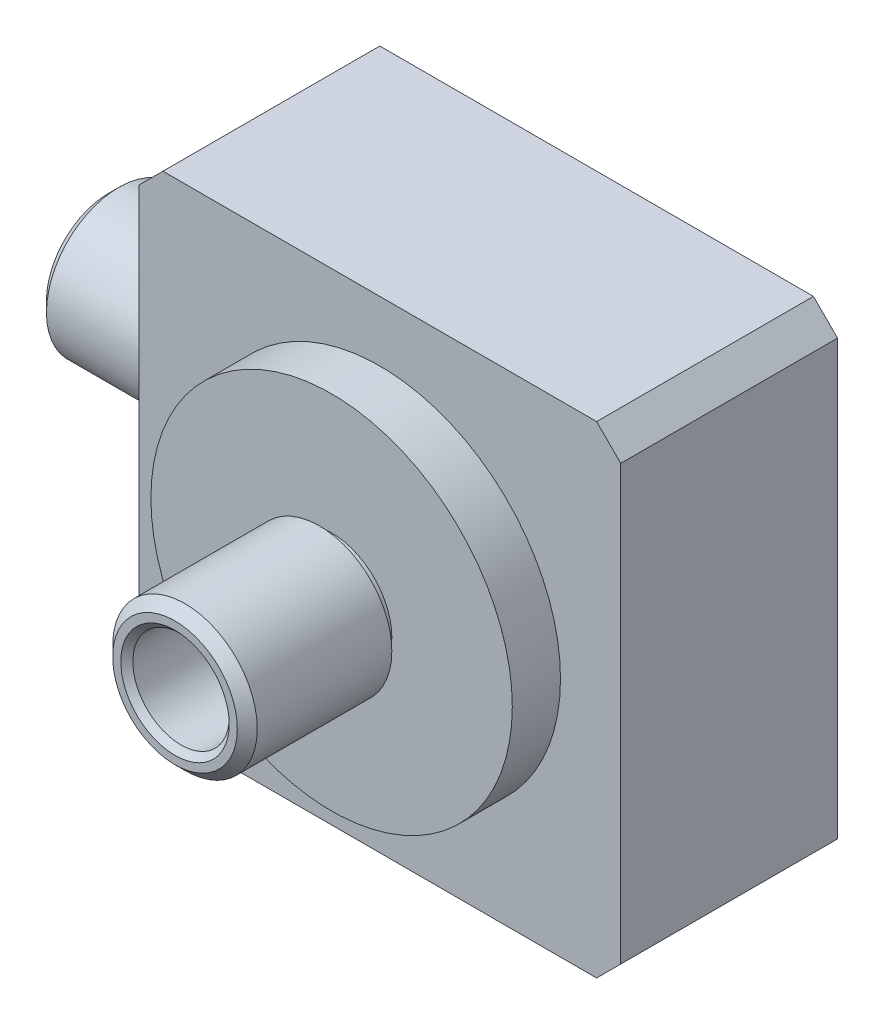
ISO-10303-21;
HEADER;
FILE_DESCRIPTION(('STEP AP214'),'2;1');
FILE_NAME('part.step','',(''),(''),'','','');
FILE_SCHEMA(('AUTOMOTIVE_DESIGN { 1 0 10303 214 1 1 1 1 }'));
ENDSEC;
DATA;
#1=APPLICATION_CONTEXT('core data for automotive mechanical design processes');
#2=APPLICATION_PROTOCOL_DEFINITION('international standard','automotive_design',2000,#1);
#3=PRODUCT_CONTEXT('',#1,'mechanical');
#4=PRODUCT('Part','Part','',(#3));
#5=PRODUCT_RELATED_PRODUCT_CATEGORY('part','',(#4));
#6=PRODUCT_DEFINITION_FORMATION('','',#4);
#7=PRODUCT_DEFINITION_CONTEXT('part definition',#1,'design');
#8=PRODUCT_DEFINITION('design','',#6,#7);
#9=PRODUCT_DEFINITION_SHAPE('','',#8);
#10=(LENGTH_UNIT() NAMED_UNIT(*) SI_UNIT(.MILLI.,.METRE.));
#11=(NAMED_UNIT(*) PLANE_ANGLE_UNIT() SI_UNIT($,.RADIAN.));
#12=(NAMED_UNIT(*) SI_UNIT($,.STERADIAN.) SOLID_ANGLE_UNIT());
#13=UNCERTAINTY_MEASURE_WITH_UNIT(LENGTH_MEASURE(1.E-05),#10,'distance_accuracy_value','');
#14=(GEOMETRIC_REPRESENTATION_CONTEXT(3) GLOBAL_UNCERTAINTY_ASSIGNED_CONTEXT((#13)) GLOBAL_UNIT_ASSIGNED_CONTEXT((#10,
#11,#12)) REPRESENTATION_CONTEXT('',''));
#15=CARTESIAN_POINT('',(0.,0.,0.));
#16=DIRECTION('',(0.,0.,1.));
#17=DIRECTION('',(1.,0.,0.));
#18=AXIS2_PLACEMENT_3D('',#15,#16,#17);
#19=CARTESIAN_POINT('',(0.,0.,0.));
#20=DIRECTION('',(0.,0.,-1.));
#21=DIRECTION('',(-1.,0.,0.));
#22=AXIS2_PLACEMENT_3D('',#19,#20,#21);
#23=PLANE('',#22);
#24=DIRECTION('',(0.,-1.,0.));
#25=VECTOR('',#24,1.);
#26=CARTESIAN_POINT('',(-20.,-20.,0.));
#27=LINE('',#26,#25);
#28=CARTESIAN_POINT('',(-20.,18.,0.));
#29=VERTEX_POINT('',#28);
#30=CARTESIAN_POINT('',(-20.,-18.,0.));
#31=VERTEX_POINT('',#30);
#32=EDGE_CURVE('E119',#29,#31,#27,.T.);
#33=ORIENTED_EDGE('',*,*,#32,.F.);
#34=DIRECTION('',(-0.70710678118655,-0.707106781186545,0.));
#35=VECTOR('',#34,1.);
#36=CARTESIAN_POINT('',(-18.9999999999999,19.0000000000001,0.));
#37=LINE('',#36,#35);
#38=CARTESIAN_POINT('',(-18.,20.,0.));
#39=VERTEX_POINT('',#38);
#40=EDGE_CURVE('E101',#29,#39,#37,.F.);
#41=ORIENTED_EDGE('',*,*,#40,.T.);
#42=DIRECTION('',(-1.,0.,0.));
#43=VECTOR('',#42,1.);
#44=CARTESIAN_POINT('',(-20.,20.,0.));
#45=LINE('',#44,#43);
#46=CARTESIAN_POINT('',(18.,20.,0.));
#47=VERTEX_POINT('',#46);
#48=EDGE_CURVE('E128',#47,#39,#45,.T.);
#49=ORIENTED_EDGE('',*,*,#48,.F.);
#50=DIRECTION('',(-0.707106781186546,0.707106781186549,0.));
#51=VECTOR('',#50,1.);
#52=CARTESIAN_POINT('',(19.,19.,0.));
#53=LINE('',#52,#51);
#54=CARTESIAN_POINT('',(20.,18.,0.));
#55=VERTEX_POINT('',#54);
#56=EDGE_CURVE('E112',#47,#55,#53,.F.);
#57=ORIENTED_EDGE('',*,*,#56,.T.);
#58=DIRECTION('',(0.,1.,0.));
#59=VECTOR('',#58,1.);
#60=CARTESIAN_POINT('',(20.,-20.,0.));
#61=LINE('',#60,#59);
#62=CARTESIAN_POINT('',(20.,-18.,0.));
#63=VERTEX_POINT('',#62);
#64=EDGE_CURVE('E132',#63,#55,#61,.T.);
#65=ORIENTED_EDGE('',*,*,#64,.F.);
#66=DIRECTION('',(0.707106781186549,0.707106781186546,0.));
#67=VECTOR('',#66,1.);
#68=CARTESIAN_POINT('',(19.,-19.,0.));
#69=LINE('',#68,#67);
#70=CARTESIAN_POINT('',(18.,-20.,0.));
#71=VERTEX_POINT('',#70);
#72=EDGE_CURVE('E182',#63,#71,#69,.F.);
#73=ORIENTED_EDGE('',*,*,#72,.T.);
#74=DIRECTION('',(1.,0.,0.));
#75=VECTOR('',#74,1.);
#76=CARTESIAN_POINT('',(-20.,-20.,0.));
#77=LINE('',#76,#75);
#78=CARTESIAN_POINT('',(-18.,-20.,0.));
#79=VERTEX_POINT('',#78);
#80=EDGE_CURVE('E127',#79,#71,#77,.T.);
#81=ORIENTED_EDGE('',*,*,#80,.F.);
#82=DIRECTION('',(0.707106781186545,-0.70710678118655,0.));
#83=VECTOR('',#82,1.);
#84=CARTESIAN_POINT('',(-19.0000000000001,-18.9999999999999,0.));
#85=LINE('',#84,#83);
#86=EDGE_CURVE('E122',#79,#31,#85,.F.);
#87=ORIENTED_EDGE('',*,*,#86,.T.);
#88=EDGE_LOOP('',(#33,#41,#49,#57,#65,#73,#81,#87));
#89=FACE_BOUND('',#88,.T.);
#90=CARTESIAN_POINT('',(0.,0.,0.));
#91=DIRECTION('',(0.,0.,-1.));
#92=DIRECTION('',(-1.,0.,0.));
#93=AXIS2_PLACEMENT_3D('',#90,#91,#92);
#94=CIRCLE('',#93,17.5);
#95=CARTESIAN_POINT('',(-17.5,0.,0.));
#96=VERTEX_POINT('',#95);
#97=EDGE_CURVE('E405',#96,#96,#94,.T.);
#98=ORIENTED_EDGE('',*,*,#97,.F.);
#99=EDGE_LOOP('',(#98));
#100=FACE_BOUND('',#99,.T.);
#101=ADVANCED_FACE('F36',(#89,#100),#23,.T.);
#102=CARTESIAN_POINT('',(0.,0.,0.));
#103=DIRECTION('',(0.,0.,-1.));
#104=DIRECTION('',(-1.,0.,0.));
#105=AXIS2_PLACEMENT_3D('',#102,#103,#104);
#106=CIRCLE('',#105,11.);
#107=CARTESIAN_POINT('',(-11.,0.,0.));
#108=VERTEX_POINT('',#107);
#109=EDGE_CURVE('E147',#108,#108,#106,.T.);
#110=ORIENTED_EDGE('',*,*,#109,.F.);
#111=EDGE_LOOP('',(#110));
#112=FACE_BOUND('',#111,.T.);
#113=CARTESIAN_POINT('',(0.,0.,0.));
#114=DIRECTION('',(0.,0.,-1.));
#115=DIRECTION('',(-1.,0.,0.));
#116=AXIS2_PLACEMENT_3D('',#113,#114,#115);
#117=CIRCLE('',#116,13.5);
#118=CARTESIAN_POINT('',(-13.5,0.,0.));
#119=VERTEX_POINT('',#118);
#120=EDGE_CURVE('E406',#119,#119,#117,.T.);
#121=ORIENTED_EDGE('',*,*,#120,.T.);
#122=EDGE_LOOP('',(#121));
#123=FACE_BOUND('',#122,.T.);
#124=ADVANCED_FACE('F342',(#112,#123),#23,.T.);
#125=CARTESIAN_POINT('',(20.001,0.,6.99999999999999));
#126=DIRECTION('',(-1.,0.,0.));
#127=DIRECTION('',(0.,0.,1.));
#128=AXIS2_PLACEMENT_3D('',#125,#126,#127);
#129=CYLINDRICAL_SURFACE('',#128,2.5);
#130=CARTESIAN_POINT('',(-11.,0.,9.49999999999999));
#131=CARTESIAN_POINT('',(-10.9999974735185,0.138518278596904,9.49999546817358));
#132=CARTESIAN_POINT('',(-10.9973570934613,0.277090172258008,9.48844877242309));
#133=CARTESIAN_POINT('',(-10.987079320306,0.550288594599323,9.4426205239383));
#134=CARTESIAN_POINT('',(-10.9794385496265,0.68491239222073,9.40832360404473));
#135=CARTESIAN_POINT('',(-10.9600095312294,0.946227671984916,9.3181319513681));
#136=CARTESIAN_POINT('',(-10.9482257885674,1.07292759495647,9.26226067201926));
#137=CARTESIAN_POINT('',(-10.921778201627,1.31515227582566,9.13058288661912));
#138=CARTESIAN_POINT('',(-10.9071143860398,1.43067714503182,9.05477657915758));
#139=CARTESIAN_POINT('',(-10.8762265816814,1.64926760444638,8.88399795539332));
#140=CARTESIAN_POINT('',(-10.8599819758326,1.75211293892049,8.78874742652499));
#141=CARTESIAN_POINT('',(-10.827906511833,1.9405138981661,8.58238102586275));
#142=CARTESIAN_POINT('',(-10.8120756930933,2.02606788121784,8.47126364930554));
#143=CARTESIAN_POINT('',(-10.7824158369221,2.17844599401787,8.23466794471631));
#144=CARTESIAN_POINT('',(-10.7686131580577,2.24503254356575,8.10903300369416));
#145=CARTESIAN_POINT('',(-10.7448696147509,2.3560606971787,7.84799049941837));
#146=CARTESIAN_POINT('',(-10.7349282488168,2.40050517717749,7.71258420793837));
#147=CARTESIAN_POINT('',(-10.7202434469831,2.46525349412718,7.43824081288346));
#148=CARTESIAN_POINT('',(-10.715415797339,2.48594892680754,7.29940073687745));
#149=CARTESIAN_POINT('',(-10.7112523406768,2.50382988451487,7.02014177278689));
#150=CARTESIAN_POINT('',(-10.711915802658,2.50101853886552,6.87972309733772));
#151=CARTESIAN_POINT('',(-10.7185835035919,2.47228016958762,6.6042271166513));
#152=CARTESIAN_POINT('',(-10.7244819412976,2.44681104599437,6.46909909380508));
#153=CARTESIAN_POINT('',(-10.7407873672743,2.37420684920502,6.20508551384517));
#154=CARTESIAN_POINT('',(-10.7511946264744,2.32707047404288,6.07620033237281));
#155=CARTESIAN_POINT('',(-10.7754474384537,2.21205734402544,5.82705932818946));
#156=CARTESIAN_POINT('',(-10.7893215597825,2.14400712086008,5.70688648223631));
#157=CARTESIAN_POINT('',(-10.8189276843241,1.98921977920408,5.47949744688893));
#158=CARTESIAN_POINT('',(-10.8346599596346,1.90247992237134,5.37228315973606));
#159=CARTESIAN_POINT('',(-10.8666615287251,1.71036518003516,5.17122143817897));
#160=CARTESIAN_POINT('',(-10.882934773515,1.60460166742827,5.07774557348364));
#161=CARTESIAN_POINT('',(-10.9138502597158,1.37871229840972,4.90979411129289));
#162=CARTESIAN_POINT('',(-10.9284924668293,1.2585861400908,4.83531891330052));
#163=CARTESIAN_POINT('',(-10.9545497424637,1.00690799179916,4.70737961202849));
#164=CARTESIAN_POINT('',(-10.9659568484873,0.875328834348159,4.65396722637767));
#165=CARTESIAN_POINT('',(-10.9841998956698,0.604745122491699,4.57011599413207));
#166=CARTESIAN_POINT('',(-10.9910365557784,0.465741739663722,4.53967353417781));
#167=CARTESIAN_POINT('',(-10.9992650071756,0.187439840192734,4.5031737625273));
#168=CARTESIAN_POINT('',(-11.0007700184113,0.0482110923370391,4.49660930868326));
#169=CARTESIAN_POINT('',(-10.9984842255063,-0.229353886680103,4.50667303985292));
#170=CARTESIAN_POINT('',(-10.9946938107912,-0.367690182720858,4.52329951940597));
#171=CARTESIAN_POINT('',(-10.9823148103741,-0.637841677218458,4.57885316690541));
#172=CARTESIAN_POINT('',(-10.973784087055,-0.769715036814425,4.61751154644373));
#173=CARTESIAN_POINT('',(-10.9528806132367,-1.0251039308776,4.71573102745707));
#174=CARTESIAN_POINT('',(-10.9405075180554,-1.14861871432289,4.77529400425326));
#175=CARTESIAN_POINT('',(-10.9130143275095,-1.38586085256056,4.91466914355533));
#176=CARTESIAN_POINT('',(-10.8978552985532,-1.49941068522719,4.99477562677315));
#177=CARTESIAN_POINT('',(-10.866546095646,-1.71163773579052,5.1725793284402));
#178=CARTESIAN_POINT('',(-10.8503957821912,-1.8103128535797,5.27027902654684));
#179=CARTESIAN_POINT('',(-10.8185287714487,-1.99201706218096,5.48283096513342));
#180=CARTESIAN_POINT('',(-10.8028272119253,-2.07469366594062,5.59798724178681));
#181=CARTESIAN_POINT('',(-10.7740023321604,-2.21953814406552,5.84084639067027));
#182=CARTESIAN_POINT('',(-10.7608788979592,-2.28170692501017,5.96854870795962));
#183=CARTESIAN_POINT('',(-10.7388274870674,-2.38333597241927,6.23218046956891));
#184=CARTESIAN_POINT('',(-10.7298753781702,-2.42292716221704,6.36805732374334));
#185=CARTESIAN_POINT('',(-10.7171411058581,-2.47865258340365,6.64476690669912));
#186=CARTESIAN_POINT('',(-10.7133580391079,-2.49479091341614,6.78559876513639));
#187=CARTESIAN_POINT('',(-10.7114502943222,-2.50296739214164,7.06465861931089));
#188=CARTESIAN_POINT('',(-10.7131941458177,-2.4955654850107,7.20286959933359));
#189=CARTESIAN_POINT('',(-10.7218446846914,-2.45813115403283,7.47601891018825));
#190=CARTESIAN_POINT('',(-10.7287513008948,-2.42809904217009,7.61095728611047));
#191=CARTESIAN_POINT('',(-10.7468826027048,-2.34653692360609,7.87324339736628));
#192=CARTESIAN_POINT('',(-10.758089666867,-2.29509457527995,8.00061969114149));
#193=CARTESIAN_POINT('',(-10.783564723281,-2.1722453660688,8.2450147069006));
#194=CARTESIAN_POINT('',(-10.7978330631966,-2.10083623731223,8.3620322503255));
#195=CARTESIAN_POINT('',(-10.828211072634,-1.93824996891049,8.58513442765527));
#196=CARTESIAN_POINT('',(-10.8443540558786,-1.84667645642834,8.69092572220737));
#197=CARTESIAN_POINT('',(-10.8764454859305,-1.64715628932417,8.88582318508195));
#198=CARTESIAN_POINT('',(-10.8923938866665,-1.53920583540675,8.97492547096596));
#199=CARTESIAN_POINT('',(-10.9225693389041,-1.30814060515056,9.13513806023371));
#200=CARTESIAN_POINT('',(-10.9367686161711,-1.1848316218762,9.20597382333313));
#201=CARTESIAN_POINT('',(-10.9615640551399,-0.927755967711687,9.32579997066295));
#202=CARTESIAN_POINT('',(-10.9721631246672,-0.793997844337693,9.37480799478667));
#203=CARTESIAN_POINT('',(-10.9867559512784,-0.55016307153962,9.44122790617612));
#204=CARTESIAN_POINT('',(-10.9916908558499,-0.441368111138487,9.46322398768929));
#205=CARTESIAN_POINT('',(-10.9983138080738,-0.221726814930915,9.49261147357934));
#206=CARTESIAN_POINT('',(-11.0000020223883,-0.1108805847171,9.50000362761916));
#207=CARTESIAN_POINT('',(-11.,0.,9.49999999999999));
#208=B_SPLINE_CURVE_WITH_KNOTS('',3,(#130,#131,#132,#133,#134,#135,#136,#137,#138,#139,#140,
#141,#142,#143,#144,#145,#146,#147,#148,#149,#150,#151,#152,#153,#154,#155,#156,#157,#158,#159,
#160,#161,#162,#163,#164,#165,#166,#167,#168,#169,#170,#171,#172,#173,#174,#175,#176,#177,#178,
#179,#180,#181,#182,#183,#184,#185,#186,#187,#188,#189,#190,#191,#192,#193,#194,#195,#196,#197,
#198,#199,#200,#201,#202,#203,#204,#205,#206,#207),.UNSPECIFIED.,.T.,.F.,(4,2,2,2,2,2,2,2,2,2,2,
2,2,2,2,2,2,2,2,2,2,2,2,2,2,2,2,2,2,2,2,2,2,2,2,2,2,2,4),(0.,0.415148849633315,
0.830578406996929,1.24555761755318,1.66053269430525,2.08192389396809,2.50335508365802,
2.92985362973414,3.35629676538239,3.77560244898082,4.19485231368757,4.60581714174235,
5.01680666753971,5.4313015743885,5.84585725297978,6.27011531803703,6.69438230269862,
7.11968464096647,7.54492006169895,7.96106941916761,8.37718817463626,8.78833576149035,
9.19952024123082,9.61696129328767,10.0344612272567,10.4603132154039,10.8861463755948,
11.3094844190899,11.732748471094,12.1460204395145,12.5592867105953,12.9708773657615,
13.382514789318,13.8031102578591,14.2238034502007,14.6504927745347,15.0768366452215,
15.4091704772436,15.74148724914),.UNSPECIFIED.);
#209=CARTESIAN_POINT('',(-11.,0.,9.49999999999999));
#210=VERTEX_POINT('',#209);
#211=EDGE_CURVE('E155',#210,#210,#208,.T.);
#212=ORIENTED_EDGE('',*,*,#211,.F.);
#213=EDGE_LOOP('',(#212));
#214=FACE_BOUND('',#213,.T.);
#215=CARTESIAN_POINT('',(-23.5,0.,6.99999999999999));
#216=DIRECTION('',(-1.,0.,0.));
#217=DIRECTION('',(0.,0.,1.));
#218=AXIS2_PLACEMENT_3D('',#215,#216,#217);
#219=CIRCLE('',#218,2.5);
#220=CARTESIAN_POINT('',(-23.5,0.,9.49999999999999));
#221=VERTEX_POINT('',#220);
#222=EDGE_CURVE('E152',#221,#221,#219,.F.);
#223=ORIENTED_EDGE('',*,*,#222,.F.);
#224=EDGE_LOOP('',(#223));
#225=FACE_BOUND('',#224,.T.);
#226=ADVANCED_FACE('F264',(#214,#225),#129,.F.);
#227=CARTESIAN_POINT('',(0.,0.,0.));
#228=DIRECTION('',(0.,0.,1.));
#229=DIRECTION('',(1.,0.,0.));
#230=AXIS2_PLACEMENT_3D('',#227,#228,#229);
#231=CYLINDRICAL_SURFACE('',#230,2.5);
#232=CARTESIAN_POINT('',(0.,0.,8.));
#233=DIRECTION('',(0.,0.,-1.));
#234=DIRECTION('',(-1.,0.,0.));
#235=AXIS2_PLACEMENT_3D('',#232,#233,#234);
#236=CIRCLE('',#235,2.5);
#237=CARTESIAN_POINT('',(-2.5,0.,8.));
#238=VERTEX_POINT('',#237);
#239=EDGE_CURVE('E144',#238,#238,#236,.T.);
#240=ORIENTED_EDGE('',*,*,#239,.T.);
#241=EDGE_LOOP('',(#240));
#242=FACE_BOUND('',#241,.T.);
#243=CARTESIAN_POINT('',(0.,0.,25.));
#244=DIRECTION('',(0.,0.,1.));
#245=DIRECTION('',(1.,0.,0.));
#246=AXIS2_PLACEMENT_3D('',#243,#244,#245);
#247=CIRCLE('',#246,2.5);
#248=CARTESIAN_POINT('',(2.5,0.,25.));
#249=VERTEX_POINT('',#248);
#250=EDGE_CURVE('E148',#249,#249,#247,.F.);
#251=ORIENTED_EDGE('',*,*,#250,.F.);
#252=EDGE_LOOP('',(#251));
#253=FACE_BOUND('',#252,.T.);
#254=ADVANCED_FACE('F279',(#242,#253),#231,.F.);
#255=CARTESIAN_POINT('',(-20.,-20.,18.));
#256=DIRECTION('',(1.,0.,0.));
#257=DIRECTION('',(0.,0.,-1.));
#258=AXIS2_PLACEMENT_3D('',#255,#256,#257);
#259=PLANE('',#258);
#260=DIRECTION('',(0.,-1.,0.));
#261=VECTOR('',#260,1.);
#262=CARTESIAN_POINT('',(-20.,-20.,18.));
#263=LINE('',#262,#261);
#264=CARTESIAN_POINT('',(-20.,18.,18.));
#265=VERTEX_POINT('',#264);
#266=CARTESIAN_POINT('',(-20.,-18.,18.));
#267=VERTEX_POINT('',#266);
#268=EDGE_CURVE('E121',#265,#267,#263,.T.);
#269=ORIENTED_EDGE('',*,*,#268,.F.);
#270=DIRECTION('',(0.,0.,-1.));
#271=VECTOR('',#270,1.);
#272=CARTESIAN_POINT('',(-20.,18.,18.));
#273=LINE('',#272,#271);
#274=EDGE_CURVE('E105',#265,#29,#273,.T.);
#275=ORIENTED_EDGE('',*,*,#274,.T.);
#276=ORIENTED_EDGE('',*,*,#32,.T.);
#277=DIRECTION('',(0.,0.,1.));
#278=VECTOR('',#277,1.);
#279=CARTESIAN_POINT('',(-20.,-18.,18.));
#280=LINE('',#279,#278);
#281=EDGE_CURVE('E123',#31,#267,#280,.T.);
#282=ORIENTED_EDGE('',*,*,#281,.T.);
#283=EDGE_LOOP('',(#269,#275,#276,#282));
#284=FACE_BOUND('',#283,.T.);
#285=CARTESIAN_POINT('',(-20.,0.,6.99999999999999));
#286=DIRECTION('',(1.,0.,0.));
#287=DIRECTION('',(0.,0.,-1.));
#288=AXIS2_PLACEMENT_3D('',#285,#286,#287);
#289=CIRCLE('',#288,5.00000000000001);
#290=CARTESIAN_POINT('',(-20.,0.,1.99999999999999));
#291=VERTEX_POINT('',#290);
#292=EDGE_CURVE('E139',#291,#291,#289,.F.);
#293=ORIENTED_EDGE('',*,*,#292,.F.);
#294=EDGE_LOOP('',(#293));
#295=FACE_BOUND('',#294,.T.);
#296=ADVANCED_FACE('F117',(#284,#295),#259,.F.);
#297=CARTESIAN_POINT('',(0.,0.,22.));
#298=DIRECTION('',(0.,0.,1.));
#299=DIRECTION('',(1.,0.,0.));
#300=AXIS2_PLACEMENT_3D('',#297,#298,#299);
#301=PLANE('',#300);
#302=CARTESIAN_POINT('',(0.,0.,22.));
#303=DIRECTION('',(0.,0.,1.));
#304=DIRECTION('',(1.,0.,0.));
#305=AXIS2_PLACEMENT_3D('',#302,#303,#304);
#306=CIRCLE('',#305,15.);
#307=CARTESIAN_POINT('',(15.,0.,22.));
#308=VERTEX_POINT('',#307);
#309=EDGE_CURVE('E220',#308,#308,#306,.T.);
#310=ORIENTED_EDGE('',*,*,#309,.T.);
#311=EDGE_LOOP('',(#310));
#312=FACE_BOUND('',#311,.T.);
#313=CARTESIAN_POINT('',(0.,0.,22.));
#314=DIRECTION('',(0.,0.,1.));
#315=DIRECTION('',(1.,0.,0.));
#316=AXIS2_PLACEMENT_3D('',#313,#314,#315);
#317=CIRCLE('',#316,5.);
#318=CARTESIAN_POINT('',(5.,0.,22.));
#319=VERTEX_POINT('',#318);
#320=EDGE_CURVE('E229',#319,#319,#317,.T.);
#321=ORIENTED_EDGE('',*,*,#320,.F.);
#322=EDGE_LOOP('',(#321));
#323=FACE_BOUND('',#322,.T.);
#324=ADVANCED_FACE('F331',(#312,#323),#301,.T.);
#325=CARTESIAN_POINT('',(0.,0.,18.));
#326=DIRECTION('',(0.,0.,-1.));
#327=DIRECTION('',(-1.,0.,0.));
#328=AXIS2_PLACEMENT_3D('',#325,#326,#327);
#329=PLANE('',#328);
#330=DIRECTION('',(-1.,0.,0.));
#331=VECTOR('',#330,1.);
#332=CARTESIAN_POINT('',(-20.,20.,18.));
#333=LINE('',#332,#331);
#334=CARTESIAN_POINT('',(18.,20.,18.));
#335=VERTEX_POINT('',#334);
#336=CARTESIAN_POINT('',(-18.,20.,18.));
#337=VERTEX_POINT('',#336);
#338=EDGE_CURVE('E215',#335,#337,#333,.T.);
#339=ORIENTED_EDGE('',*,*,#338,.T.);
#340=DIRECTION('',(0.70710678118655,0.707106781186545,0.));
#341=VECTOR('',#340,1.);
#342=CARTESIAN_POINT('',(-20.,18.,18.));
#343=LINE('',#342,#341);
#344=EDGE_CURVE('E193',#337,#265,#343,.F.);
#345=ORIENTED_EDGE('',*,*,#344,.T.);
#346=ORIENTED_EDGE('',*,*,#268,.T.);
#347=DIRECTION('',(-0.707106781186545,0.70710678118655,0.));
#348=VECTOR('',#347,1.);
#349=CARTESIAN_POINT('',(-18.,-20.,18.));
#350=LINE('',#349,#348);
#351=CARTESIAN_POINT('',(-18.,-20.,18.));
#352=VERTEX_POINT('',#351);
#353=EDGE_CURVE('E56',#267,#352,#350,.F.);
#354=ORIENTED_EDGE('',*,*,#353,.T.);
#355=DIRECTION('',(1.,0.,0.));
#356=VECTOR('',#355,1.);
#357=CARTESIAN_POINT('',(-20.,-20.,18.));
#358=LINE('',#357,#356);
#359=CARTESIAN_POINT('',(18.,-20.,18.));
#360=VERTEX_POINT('',#359);
#361=EDGE_CURVE('E140',#352,#360,#358,.T.);
#362=ORIENTED_EDGE('',*,*,#361,.T.);
#363=DIRECTION('',(-0.707106781186549,-0.707106781186546,0.));
#364=VECTOR('',#363,1.);
#365=CARTESIAN_POINT('',(20.,-18.,18.));
#366=LINE('',#365,#364);
#367=CARTESIAN_POINT('',(20.,-18.,18.));
#368=VERTEX_POINT('',#367);
#369=EDGE_CURVE('E189',#360,#368,#366,.F.);
#370=ORIENTED_EDGE('',*,*,#369,.T.);
#371=DIRECTION('',(0.,1.,0.));
#372=VECTOR('',#371,1.);
#373=CARTESIAN_POINT('',(20.,-20.,18.));
#374=LINE('',#373,#372);
#375=CARTESIAN_POINT('',(20.,18.,18.));
#376=VERTEX_POINT('',#375);
#377=EDGE_CURVE('E130',#368,#376,#374,.T.);
#378=ORIENTED_EDGE('',*,*,#377,.T.);
#379=DIRECTION('',(0.707106781186546,-0.707106781186549,0.));
#380=VECTOR('',#379,1.);
#381=CARTESIAN_POINT('',(18.,20.,18.));
#382=LINE('',#381,#380);
#383=EDGE_CURVE('E191',#376,#335,#382,.F.);
#384=ORIENTED_EDGE('',*,*,#383,.T.);
#385=EDGE_LOOP('',(#339,#345,#346,#354,#362,#370,#378,#384));
#386=FACE_BOUND('',#385,.T.);
#387=CARTESIAN_POINT('',(0.,0.,18.));
#388=DIRECTION('',(0.,0.,-1.));
#389=DIRECTION('',(-1.,0.,0.));
#390=AXIS2_PLACEMENT_3D('',#387,#388,#389);
#391=CIRCLE('',#390,15.);
#392=CARTESIAN_POINT('',(-15.,0.,18.));
#393=VERTEX_POINT('',#392);
#394=EDGE_CURVE('E136',#393,#393,#391,.F.);
#395=ORIENTED_EDGE('',*,*,#394,.F.);
#396=EDGE_LOOP('',(#395));
#397=FACE_BOUND('',#396,.T.);
#398=ADVANCED_FACE('F334',(#386,#397),#329,.F.);
#399=CARTESIAN_POINT('',(20.,-20.,18.));
#400=DIRECTION('',(-1.,0.,0.));
#401=DIRECTION('',(0.,0.,1.));
#402=AXIS2_PLACEMENT_3D('',#399,#400,#401);
#403=PLANE('',#402);
#404=ORIENTED_EDGE('',*,*,#64,.T.);
#405=DIRECTION('',(0.,0.,1.));
#406=VECTOR('',#405,1.);
#407=CARTESIAN_POINT('',(20.,18.,18.));
#408=LINE('',#407,#406);
#409=EDGE_CURVE('E198',#55,#376,#408,.T.);
#410=ORIENTED_EDGE('',*,*,#409,.T.);
#411=ORIENTED_EDGE('',*,*,#377,.F.);
#412=DIRECTION('',(0.,0.,-1.));
#413=VECTOR('',#412,1.);
#414=CARTESIAN_POINT('',(20.,-18.,18.));
#415=LINE('',#414,#413);
#416=EDGE_CURVE('E195',#368,#63,#415,.T.);
#417=ORIENTED_EDGE('',*,*,#416,.T.);
#418=EDGE_LOOP('',(#404,#410,#411,#417));
#419=FACE_BOUND('',#418,.T.);
#420=ADVANCED_FACE('F211',(#419),#403,.F.);
#421=CARTESIAN_POINT('',(-20.,20.,18.));
#422=DIRECTION('',(0.,-1.,0.));
#423=DIRECTION('',(0.,0.,-1.));
#424=AXIS2_PLACEMENT_3D('',#421,#422,#423);
#425=PLANE('',#424);
#426=ORIENTED_EDGE('',*,*,#48,.T.);
#427=DIRECTION('',(0.,0.,1.));
#428=VECTOR('',#427,1.);
#429=CARTESIAN_POINT('',(-18.,20.,18.));
#430=LINE('',#429,#428);
#431=EDGE_CURVE('E106',#39,#337,#430,.T.);
#432=ORIENTED_EDGE('',*,*,#431,.T.);
#433=ORIENTED_EDGE('',*,*,#338,.F.);
#434=DIRECTION('',(0.,0.,-1.));
#435=VECTOR('',#434,1.);
#436=CARTESIAN_POINT('',(18.,20.,18.));
#437=LINE('',#436,#435);
#438=EDGE_CURVE('E111',#335,#47,#437,.T.);
#439=ORIENTED_EDGE('',*,*,#438,.T.);
#440=EDGE_LOOP('',(#426,#432,#433,#439));
#441=FACE_BOUND('',#440,.T.);
#442=ADVANCED_FACE('F345',(#441),#425,.F.);
#443=CARTESIAN_POINT('',(-20.,-20.,18.));
#444=DIRECTION('',(0.,1.,0.));
#445=DIRECTION('',(0.,0.,1.));
#446=AXIS2_PLACEMENT_3D('',#443,#444,#445);
#447=PLANE('',#446);
#448=ORIENTED_EDGE('',*,*,#80,.T.);
#449=DIRECTION('',(0.,0.,1.));
#450=VECTOR('',#449,1.);
#451=CARTESIAN_POINT('',(18.,-20.,18.));
#452=LINE('',#451,#450);
#453=EDGE_CURVE('E11',#71,#360,#452,.T.);
#454=ORIENTED_EDGE('',*,*,#453,.T.);
#455=ORIENTED_EDGE('',*,*,#361,.F.);
#456=DIRECTION('',(0.,0.,-1.));
#457=VECTOR('',#456,1.);
#458=CARTESIAN_POINT('',(-18.,-20.,18.));
#459=LINE('',#458,#457);
#460=EDGE_CURVE('E44',#352,#79,#459,.T.);
#461=ORIENTED_EDGE('',*,*,#460,.T.);
#462=EDGE_LOOP('',(#448,#454,#455,#461));
#463=FACE_BOUND('',#462,.T.);
#464=ADVANCED_FACE('F201',(#463),#447,.F.);
#465=CARTESIAN_POINT('',(0.,0.,22.));
#466=DIRECTION('',(0.,0.,-1.));
#467=DIRECTION('',(-1.,0.,0.));
#468=AXIS2_PLACEMENT_3D('',#465,#466,#467);
#469=CYLINDRICAL_SURFACE('',#468,15.);
#470=ORIENTED_EDGE('',*,*,#309,.F.);
#471=EDGE_LOOP('',(#470));
#472=FACE_BOUND('',#471,.T.);
#473=ORIENTED_EDGE('',*,*,#394,.T.);
#474=EDGE_LOOP('',(#473));
#475=FACE_BOUND('',#474,.T.);
#476=ADVANCED_FACE('F329',(#472,#475),#469,.T.);
#477=CARTESIAN_POINT('',(0.,0.,23.));
#478=DIRECTION('',(0.,0.,-1.));
#479=DIRECTION('',(-1.,0.,0.));
#480=AXIS2_PLACEMENT_3D('',#477,#478,#479);
#481=CYLINDRICAL_SURFACE('',#480,5.);
#482=CARTESIAN_POINT('',(0.,0.,23.));
#483=DIRECTION('',(0.,0.,1.));
#484=DIRECTION('',(1.,0.,0.));
#485=AXIS2_PLACEMENT_3D('',#482,#483,#484);
#486=CIRCLE('',#485,5.);
#487=CARTESIAN_POINT('',(5.,0.,23.));
#488=VERTEX_POINT('',#487);
#489=EDGE_CURVE('E225',#488,#488,#486,.T.);
#490=ORIENTED_EDGE('',*,*,#489,.F.);
#491=EDGE_LOOP('',(#490));
#492=FACE_BOUND('',#491,.T.);
#493=ORIENTED_EDGE('',*,*,#320,.T.);
#494=EDGE_LOOP('',(#493));
#495=FACE_BOUND('',#494,.T.);
#496=ADVANCED_FACE('F322',(#492,#495),#481,.T.);
#497=CARTESIAN_POINT('',(0.,0.,23.));
#498=DIRECTION('',(0.,0.,1.));
#499=DIRECTION('',(1.,0.,0.));
#500=AXIS2_PLACEMENT_3D('',#497,#498,#499);
#501=PLANE('',#500);
#502=CARTESIAN_POINT('',(0.,0.,23.));
#503=DIRECTION('',(0.,0.,1.));
#504=DIRECTION('',(1.,0.,0.));
#505=AXIS2_PLACEMENT_3D('',#502,#503,#504);
#506=CIRCLE('',#505,6.);
#507=CARTESIAN_POINT('',(6.,0.,23.));
#508=VERTEX_POINT('',#507);
#509=EDGE_CURVE('E234',#508,#508,#506,.T.);
#510=ORIENTED_EDGE('',*,*,#509,.F.);
#511=EDGE_LOOP('',(#510));
#512=FACE_BOUND('',#511,.T.);
#513=ORIENTED_EDGE('',*,*,#489,.T.);
#514=EDGE_LOOP('',(#513));
#515=FACE_BOUND('',#514,.T.);
#516=ADVANCED_FACE('F319',(#512,#515),#501,.F.);
#517=CARTESIAN_POINT('',(0.,0.,35.));
#518=DIRECTION('',(0.,0.,-1.));
#519=DIRECTION('',(-1.,0.,0.));
#520=AXIS2_PLACEMENT_3D('',#517,#518,#519);
#521=CYLINDRICAL_SURFACE('',#520,6.);
#522=CARTESIAN_POINT('',(0.,0.,34.172));
#523=DIRECTION('',(0.,0.,1.));
#524=DIRECTION('',(1.,0.,0.));
#525=AXIS2_PLACEMENT_3D('',#522,#523,#524);
#526=CIRCLE('',#525,6.);
#527=CARTESIAN_POINT('',(6.,0.,34.172));
#528=VERTEX_POINT('',#527);
#529=EDGE_CURVE('E171',#528,#528,#526,.F.);
#530=ORIENTED_EDGE('',*,*,#529,.T.);
#531=EDGE_LOOP('',(#530));
#532=FACE_BOUND('',#531,.T.);
#533=ORIENTED_EDGE('',*,*,#509,.T.);
#534=EDGE_LOOP('',(#533));
#535=FACE_BOUND('',#534,.T.);
#536=ADVANCED_FACE('F317',(#532,#535),#521,.T.);
#537=CARTESIAN_POINT('',(0.,0.,35.));
#538=DIRECTION('',(0.,0.,1.));
#539=DIRECTION('',(1.,0.,0.));
#540=AXIS2_PLACEMENT_3D('',#537,#538,#539);
#541=PLANE('',#540);
#542=CARTESIAN_POINT('',(0.,0.,35.));
#543=DIRECTION('',(0.,0.,1.));
#544=DIRECTION('',(1.,0.,0.));
#545=AXIS2_PLACEMENT_3D('',#542,#543,#544);
#546=CIRCLE('',#545,5.172);
#547=CARTESIAN_POINT('',(5.172,0.,35.));
#548=VERTEX_POINT('',#547);
#549=EDGE_CURVE('E168',#548,#548,#546,.T.);
#550=ORIENTED_EDGE('',*,*,#549,.T.);
#551=EDGE_LOOP('',(#550));
#552=FACE_BOUND('',#551,.T.);
#553=CARTESIAN_POINT('',(0.,0.,35.));
#554=DIRECTION('',(0.,0.,1.));
#555=DIRECTION('',(1.,0.,0.));
#556=AXIS2_PLACEMENT_3D('',#553,#554,#555);
#557=CIRCLE('',#556,4.50000000000001);
#558=CARTESIAN_POINT('',(4.50000000000001,0.,35.));
#559=VERTEX_POINT('',#558);
#560=EDGE_CURVE('E159',#559,#559,#557,.F.);
#561=ORIENTED_EDGE('',*,*,#560,.T.);
#562=EDGE_LOOP('',(#561));
#563=FACE_BOUND('',#562,.T.);
#564=ADVANCED_FACE('F313',(#552,#563),#541,.T.);
#565=CARTESIAN_POINT('',(-21.,0.,6.99999999999999));
#566=DIRECTION('',(1.,0.,0.));
#567=DIRECTION('',(0.,0.,-1.));
#568=AXIS2_PLACEMENT_3D('',#565,#566,#567);
#569=CYLINDRICAL_SURFACE('',#568,5.00000000000001);
#570=CARTESIAN_POINT('',(-21.,0.,6.99999999999999));
#571=DIRECTION('',(-1.,0.,0.));
#572=DIRECTION('',(0.,0.,1.));
#573=AXIS2_PLACEMENT_3D('',#570,#571,#572);
#574=CIRCLE('',#573,5.00000000000001);
#575=CARTESIAN_POINT('',(-21.,0.,12.));
#576=VERTEX_POINT('',#575);
#577=EDGE_CURVE('E238',#576,#576,#574,.T.);
#578=ORIENTED_EDGE('',*,*,#577,.F.);
#579=EDGE_LOOP('',(#578));
#580=FACE_BOUND('',#579,.T.);
#581=ORIENTED_EDGE('',*,*,#292,.T.);
#582=EDGE_LOOP('',(#581));
#583=FACE_BOUND('',#582,.T.);
#584=ADVANCED_FACE('F306',(#580,#583),#569,.T.);
#585=CARTESIAN_POINT('',(-21.,0.,6.99999999999999));
#586=DIRECTION('',(-1.,0.,0.));
#587=DIRECTION('',(0.,0.,1.));
#588=AXIS2_PLACEMENT_3D('',#585,#586,#587);
#589=PLANE('',#588);
#590=CARTESIAN_POINT('',(-21.,0.,6.99999999999999));
#591=DIRECTION('',(-1.,0.,0.));
#592=DIRECTION('',(0.,0.,1.));
#593=AXIS2_PLACEMENT_3D('',#590,#591,#592);
#594=CIRCLE('',#593,6.);
#595=CARTESIAN_POINT('',(-21.,0.,13.));
#596=VERTEX_POINT('',#595);
#597=EDGE_CURVE('E241',#596,#596,#594,.T.);
#598=ORIENTED_EDGE('',*,*,#597,.F.);
#599=EDGE_LOOP('',(#598));
#600=FACE_BOUND('',#599,.T.);
#601=ORIENTED_EDGE('',*,*,#577,.T.);
#602=EDGE_LOOP('',(#601));
#603=FACE_BOUND('',#602,.T.);
#604=ADVANCED_FACE('F303',(#600,#603),#589,.F.);
#605=CARTESIAN_POINT('',(-33.5,0.,6.99999999999999));
#606=DIRECTION('',(1.,0.,0.));
#607=DIRECTION('',(0.,0.,-1.));
#608=AXIS2_PLACEMENT_3D('',#605,#606,#607);
#609=CYLINDRICAL_SURFACE('',#608,6.);
#610=CARTESIAN_POINT('',(-32.672,0.,6.99999999999999));
#611=DIRECTION('',(-1.,0.,0.));
#612=DIRECTION('',(0.,0.,1.));
#613=AXIS2_PLACEMENT_3D('',#610,#611,#612);
#614=CIRCLE('',#613,6.);
#615=CARTESIAN_POINT('',(-32.672,0.,13.));
#616=VERTEX_POINT('',#615);
#617=EDGE_CURVE('E177',#616,#616,#614,.F.);
#618=ORIENTED_EDGE('',*,*,#617,.T.);
#619=EDGE_LOOP('',(#618));
#620=FACE_BOUND('',#619,.T.);
#621=ORIENTED_EDGE('',*,*,#597,.T.);
#622=EDGE_LOOP('',(#621));
#623=FACE_BOUND('',#622,.T.);
#624=ADVANCED_FACE('F301',(#620,#623),#609,.T.);
#625=CARTESIAN_POINT('',(-33.5,0.,6.99999999999999));
#626=DIRECTION('',(-1.,0.,0.));
#627=DIRECTION('',(0.,0.,1.));
#628=AXIS2_PLACEMENT_3D('',#625,#626,#627);
#629=PLANE('',#628);
#630=CARTESIAN_POINT('',(-33.5,0.,6.99999999999999));
#631=DIRECTION('',(-1.,0.,0.));
#632=DIRECTION('',(0.,0.,1.));
#633=AXIS2_PLACEMENT_3D('',#630,#631,#632);
#634=CIRCLE('',#633,5.17199999999997);
#635=CARTESIAN_POINT('',(-33.5,0.,12.172));
#636=VERTEX_POINT('',#635);
#637=EDGE_CURVE('E174',#636,#636,#634,.T.);
#638=ORIENTED_EDGE('',*,*,#637,.T.);
#639=EDGE_LOOP('',(#638));
#640=FACE_BOUND('',#639,.T.);
#641=CARTESIAN_POINT('',(-33.5,0.,6.99999999999999));
#642=DIRECTION('',(-1.,0.,0.));
#643=DIRECTION('',(0.,0.,1.));
#644=AXIS2_PLACEMENT_3D('',#641,#642,#643);
#645=CIRCLE('',#644,4.50000000000001);
#646=CARTESIAN_POINT('',(-33.5,0.,11.5));
#647=VERTEX_POINT('',#646);
#648=EDGE_CURVE('E165',#647,#647,#645,.F.);
#649=ORIENTED_EDGE('',*,*,#648,.T.);
#650=EDGE_LOOP('',(#649));
#651=FACE_BOUND('',#650,.T.);
#652=ADVANCED_FACE('F297',(#640,#651),#629,.T.);
#653=CARTESIAN_POINT('',(0.,0.,8.));
#654=DIRECTION('',(0.,0.,-1.));
#655=DIRECTION('',(-1.,0.,0.));
#656=AXIS2_PLACEMENT_3D('',#653,#654,#655);
#657=PLANE('',#656);
#658=ORIENTED_EDGE('',*,*,#239,.F.);
#659=EDGE_LOOP('',(#658));
#660=FACE_BOUND('',#659,.T.);
#661=CARTESIAN_POINT('',(0.,0.,8.));
#662=DIRECTION('',(0.,0.,-1.));
#663=DIRECTION('',(-1.,0.,0.));
#664=AXIS2_PLACEMENT_3D('',#661,#662,#663);
#665=CIRCLE('',#664,3.5);
#666=CARTESIAN_POINT('',(-3.5,0.,8.));
#667=VERTEX_POINT('',#666);
#668=EDGE_CURVE('E244',#667,#667,#665,.T.);
#669=ORIENTED_EDGE('',*,*,#668,.T.);
#670=EDGE_LOOP('',(#669));
#671=FACE_BOUND('',#670,.T.);
#672=ADVANCED_FACE('F293',(#660,#671),#657,.T.);
#673=CARTESIAN_POINT('',(0.,0.,8.));
#674=DIRECTION('',(0.,0.,1.));
#675=DIRECTION('',(1.,0.,0.));
#676=AXIS2_PLACEMENT_3D('',#673,#674,#675);
#677=CONICAL_SURFACE('',#676,3.5,1.0471975511966);
#678=CARTESIAN_POINT('',(0.,0.,11.));
#679=DIRECTION('',(0.,0.,-1.));
#680=DIRECTION('',(-1.,0.,0.));
#681=AXIS2_PLACEMENT_3D('',#678,#679,#680);
#682=CIRCLE('',#681,8.69615242270661);
#683=CARTESIAN_POINT('',(-8.69615242270661,0.,11.));
#684=VERTEX_POINT('',#683);
#685=EDGE_CURVE('E247',#684,#684,#682,.T.);
#686=ORIENTED_EDGE('',*,*,#685,.T.);
#687=EDGE_LOOP('',(#686));
#688=FACE_BOUND('',#687,.T.);
#689=ORIENTED_EDGE('',*,*,#668,.F.);
#690=EDGE_LOOP('',(#689));
#691=FACE_BOUND('',#690,.T.);
#692=ADVANCED_FACE('F289',(#688,#691),#677,.T.);
#693=CARTESIAN_POINT('',(8.69615242270662,0.,11.));
#694=DIRECTION('',(0.,0.,-1.));
#695=DIRECTION('',(-1.,0.,0.));
#696=AXIS2_PLACEMENT_3D('',#693,#694,#695);
#697=PLANE('',#696);
#698=CARTESIAN_POINT('',(0.,0.,11.));
#699=DIRECTION('',(0.,0.,-1.));
#700=DIRECTION('',(-1.,0.,0.));
#701=AXIS2_PLACEMENT_3D('',#698,#699,#700);
#702=CIRCLE('',#701,11.);
#703=CARTESIAN_POINT('',(-11.,0.,11.));
#704=VERTEX_POINT('',#703);
#705=EDGE_CURVE('E250',#704,#704,#702,.T.);
#706=ORIENTED_EDGE('',*,*,#705,.T.);
#707=EDGE_LOOP('',(#706));
#708=FACE_BOUND('',#707,.T.);
#709=ORIENTED_EDGE('',*,*,#685,.F.);
#710=EDGE_LOOP('',(#709));
#711=FACE_BOUND('',#710,.T.);
#712=ADVANCED_FACE('F285',(#708,#711),#697,.T.);
#713=CARTESIAN_POINT('',(0.,0.,0.));
#714=DIRECTION('',(0.,0.,-1.));
#715=DIRECTION('',(-1.,0.,0.));
#716=AXIS2_PLACEMENT_3D('',#713,#714,#715);
#717=CYLINDRICAL_SURFACE('',#716,11.);
#718=ORIENTED_EDGE('',*,*,#211,.T.);
#719=EDGE_LOOP('',(#718));
#720=FACE_BOUND('',#719,.T.);
#721=ORIENTED_EDGE('',*,*,#109,.T.);
#722=EDGE_LOOP('',(#721));
#723=FACE_BOUND('',#722,.T.);
#724=ORIENTED_EDGE('',*,*,#705,.F.);
#725=EDGE_LOOP('',(#724));
#726=FACE_BOUND('',#725,.T.);
#727=ADVANCED_FACE('F273',(#720,#723,#726),#717,.F.);
#728=CARTESIAN_POINT('',(0.,0.,25.));
#729=DIRECTION('',(0.,0.,1.));
#730=DIRECTION('',(1.,0.,0.));
#731=AXIS2_PLACEMENT_3D('',#728,#729,#730);
#732=PLANE('',#731);
#733=CARTESIAN_POINT('',(0.,0.,25.));
#734=DIRECTION('',(0.,0.,1.));
#735=DIRECTION('',(1.,0.,0.));
#736=AXIS2_PLACEMENT_3D('',#733,#734,#735);
#737=CIRCLE('',#736,4.);
#738=CARTESIAN_POINT('',(4.,0.,25.));
#739=VERTEX_POINT('',#738);
#740=EDGE_CURVE('E151',#739,#739,#737,.T.);
#741=ORIENTED_EDGE('',*,*,#740,.T.);
#742=EDGE_LOOP('',(#741));
#743=FACE_BOUND('',#742,.T.);
#744=ORIENTED_EDGE('',*,*,#250,.T.);
#745=EDGE_LOOP('',(#744));
#746=FACE_BOUND('',#745,.T.);
#747=ADVANCED_FACE('F269',(#743,#746),#732,.T.);
#748=CARTESIAN_POINT('',(0.,0.,25.));
#749=DIRECTION('',(0.,0.,1.));
#750=DIRECTION('',(1.,0.,0.));
#751=AXIS2_PLACEMENT_3D('',#748,#749,#750);
#752=CYLINDRICAL_SURFACE('',#751,4.);
#753=CARTESIAN_POINT('',(0.,0.,34.5));
#754=DIRECTION('',(0.,0.,1.));
#755=DIRECTION('',(1.,0.,0.));
#756=AXIS2_PLACEMENT_3D('',#753,#754,#755);
#757=CIRCLE('',#756,4.);
#758=CARTESIAN_POINT('',(4.,0.,34.5));
#759=VERTEX_POINT('',#758);
#760=EDGE_CURVE('E143',#759,#759,#757,.T.);
#761=ORIENTED_EDGE('',*,*,#760,.T.);
#762=EDGE_LOOP('',(#761));
#763=FACE_BOUND('',#762,.T.);
#764=ORIENTED_EDGE('',*,*,#740,.F.);
#765=EDGE_LOOP('',(#764));
#766=FACE_BOUND('',#765,.T.);
#767=ADVANCED_FACE('F272',(#763,#766),#752,.F.);
#768=CARTESIAN_POINT('',(-23.5,0.,6.99999999999999));
#769=DIRECTION('',(-1.,0.,0.));
#770=DIRECTION('',(0.,0.,1.));
#771=AXIS2_PLACEMENT_3D('',#768,#769,#770);
#772=PLANE('',#771);
#773=CARTESIAN_POINT('',(-23.5,0.,6.99999999999999));
#774=DIRECTION('',(-1.,0.,0.));
#775=DIRECTION('',(0.,0.,1.));
#776=AXIS2_PLACEMENT_3D('',#773,#774,#775);
#777=CIRCLE('',#776,4.);
#778=CARTESIAN_POINT('',(-23.5,0.,11.));
#779=VERTEX_POINT('',#778);
#780=EDGE_CURVE('E156',#779,#779,#777,.T.);
#781=ORIENTED_EDGE('',*,*,#780,.T.);
#782=EDGE_LOOP('',(#781));
#783=FACE_BOUND('',#782,.T.);
#784=ORIENTED_EDGE('',*,*,#222,.T.);
#785=EDGE_LOOP('',(#784));
#786=FACE_BOUND('',#785,.T.);
#787=ADVANCED_FACE('F277',(#783,#786),#772,.T.);
#788=CARTESIAN_POINT('',(-23.5,0.,6.99999999999999));
#789=DIRECTION('',(-1.,0.,0.));
#790=DIRECTION('',(0.,0.,1.));
#791=AXIS2_PLACEMENT_3D('',#788,#789,#790);
#792=CYLINDRICAL_SURFACE('',#791,4.);
#793=CARTESIAN_POINT('',(-33.,0.,6.99999999999999));
#794=DIRECTION('',(-1.,0.,0.));
#795=DIRECTION('',(0.,0.,1.));
#796=AXIS2_PLACEMENT_3D('',#793,#794,#795);
#797=CIRCLE('',#796,4.);
#798=CARTESIAN_POINT('',(-33.,0.,11.));
#799=VERTEX_POINT('',#798);
#800=EDGE_CURVE('E162',#799,#799,#797,.T.);
#801=ORIENTED_EDGE('',*,*,#800,.T.);
#802=EDGE_LOOP('',(#801));
#803=FACE_BOUND('',#802,.T.);
#804=ORIENTED_EDGE('',*,*,#780,.F.);
#805=EDGE_LOOP('',(#804));
#806=FACE_BOUND('',#805,.T.);
#807=ADVANCED_FACE('F357',(#803,#806),#792,.F.);
#808=CARTESIAN_POINT('',(0.,0.,34.5));
#809=DIRECTION('',(0.,0.,1.));
#810=DIRECTION('',(1.,0.,0.));
#811=AXIS2_PLACEMENT_3D('',#808,#809,#810);
#812=CONICAL_SURFACE('',#811,4.,0.785398163397459);
#813=ORIENTED_EDGE('',*,*,#560,.F.);
#814=EDGE_LOOP('',(#813));
#815=FACE_BOUND('',#814,.T.);
#816=ORIENTED_EDGE('',*,*,#760,.F.);
#817=EDGE_LOOP('',(#816));
#818=FACE_BOUND('',#817,.T.);
#819=ADVANCED_FACE('F353',(#815,#818),#812,.F.);
#820=CARTESIAN_POINT('',(-33.,0.,6.99999999999999));
#821=DIRECTION('',(-1.,0.,0.));
#822=DIRECTION('',(0.,0.,1.));
#823=AXIS2_PLACEMENT_3D('',#820,#821,#822);
#824=CONICAL_SURFACE('',#823,4.,0.785398163397457);
#825=ORIENTED_EDGE('',*,*,#648,.F.);
#826=EDGE_LOOP('',(#825));
#827=FACE_BOUND('',#826,.T.);
#828=ORIENTED_EDGE('',*,*,#800,.F.);
#829=EDGE_LOOP('',(#828));
#830=FACE_BOUND('',#829,.T.);
#831=ADVANCED_FACE('F356',(#827,#830),#824,.F.);
#832=CARTESIAN_POINT('',(0.,0.,35.));
#833=DIRECTION('',(0.,0.,-1.));
#834=DIRECTION('',(-1.,0.,0.));
#835=AXIS2_PLACEMENT_3D('',#832,#833,#834);
#836=CONICAL_SURFACE('',#835,5.172,0.785398163397445);
#837=ORIENTED_EDGE('',*,*,#529,.F.);
#838=EDGE_LOOP('',(#837));
#839=FACE_BOUND('',#838,.T.);
#840=ORIENTED_EDGE('',*,*,#549,.F.);
#841=EDGE_LOOP('',(#840));
#842=FACE_BOUND('',#841,.T.);
#843=ADVANCED_FACE('F361',(#839,#842),#836,.T.);
#844=CARTESIAN_POINT('',(-33.5,0.,6.99999999999999));
#845=DIRECTION('',(1.,0.,0.));
#846=DIRECTION('',(0.,0.,-1.));
#847=AXIS2_PLACEMENT_3D('',#844,#845,#846);
#848=CONICAL_SURFACE('',#847,5.17199999999997,0.785398163397449);
#849=ORIENTED_EDGE('',*,*,#617,.F.);
#850=EDGE_LOOP('',(#849));
#851=FACE_BOUND('',#850,.T.);
#852=ORIENTED_EDGE('',*,*,#637,.F.);
#853=EDGE_LOOP('',(#852));
#854=FACE_BOUND('',#853,.T.);
#855=ADVANCED_FACE('F365',(#851,#854),#848,.T.);
#856=CARTESIAN_POINT('',(-20.,18.,18.));
#857=DIRECTION('',(0.707106781186545,-0.70710678118655,0.));
#858=DIRECTION('',(0.,0.,-1.));
#859=AXIS2_PLACEMENT_3D('',#856,#857,#858);
#860=PLANE('',#859);
#861=ORIENTED_EDGE('',*,*,#344,.F.);
#862=ORIENTED_EDGE('',*,*,#431,.F.);
#863=ORIENTED_EDGE('',*,*,#40,.F.);
#864=ORIENTED_EDGE('',*,*,#274,.F.);
#865=EDGE_LOOP('',(#861,#862,#863,#864));
#866=FACE_BOUND('',#865,.T.);
#867=ADVANCED_FACE('F104',(#866),#860,.F.);
#868=CARTESIAN_POINT('',(18.,20.,18.));
#869=DIRECTION('',(-0.707106781186549,-0.707106781186546,0.));
#870=DIRECTION('',(0.,0.,-1.));
#871=AXIS2_PLACEMENT_3D('',#868,#869,#870);
#872=PLANE('',#871);
#873=ORIENTED_EDGE('',*,*,#383,.F.);
#874=ORIENTED_EDGE('',*,*,#409,.F.);
#875=ORIENTED_EDGE('',*,*,#56,.F.);
#876=ORIENTED_EDGE('',*,*,#438,.F.);
#877=EDGE_LOOP('',(#873,#874,#875,#876));
#878=FACE_BOUND('',#877,.T.);
#879=ADVANCED_FACE('F372',(#878),#872,.F.);
#880=CARTESIAN_POINT('',(20.,-18.,18.));
#881=DIRECTION('',(-0.707106781186546,0.707106781186549,0.));
#882=DIRECTION('',(0.,0.,-1.));
#883=AXIS2_PLACEMENT_3D('',#880,#881,#882);
#884=PLANE('',#883);
#885=ORIENTED_EDGE('',*,*,#369,.F.);
#886=ORIENTED_EDGE('',*,*,#453,.F.);
#887=ORIENTED_EDGE('',*,*,#72,.F.);
#888=ORIENTED_EDGE('',*,*,#416,.F.);
#889=EDGE_LOOP('',(#885,#886,#887,#888));
#890=FACE_BOUND('',#889,.T.);
#891=ADVANCED_FACE('F208',(#890),#884,.F.);
#892=CARTESIAN_POINT('',(-18.,-20.,18.));
#893=DIRECTION('',(0.70710678118655,0.707106781186545,0.));
#894=DIRECTION('',(0.,0.,-1.));
#895=AXIS2_PLACEMENT_3D('',#892,#893,#894);
#896=PLANE('',#895);
#897=ORIENTED_EDGE('',*,*,#353,.F.);
#898=ORIENTED_EDGE('',*,*,#281,.F.);
#899=ORIENTED_EDGE('',*,*,#86,.F.);
#900=ORIENTED_EDGE('',*,*,#460,.F.);
#901=EDGE_LOOP('',(#897,#898,#899,#900));
#902=FACE_BOUND('',#901,.T.);
#903=ADVANCED_FACE('F38',(#902),#896,.F.);
#904=CARTESIAN_POINT('',(0.,0.,0.));
#905=DIRECTION('',(0.,0.,-1.));
#906=DIRECTION('',(-1.,0.,0.));
#907=AXIS2_PLACEMENT_3D('',#904,#905,#906);
#908=TOROIDAL_SURFACE('',#907,15.5,2.);
#909=ORIENTED_EDGE('',*,*,#97,.T.);
#910=EDGE_LOOP('',(#909));
#911=FACE_BOUND('',#910,.T.);
#912=ORIENTED_EDGE('',*,*,#120,.F.);
#913=EDGE_LOOP('',(#912));
#914=FACE_BOUND('',#913,.T.);
#915=ADVANCED_FACE('F379',(#911,#914),#908,.F.);
#916=CLOSED_SHELL('',(#101,#124,#226,#254,#296,#324,#398,#420,#442,#464,#476,#496,#516,#536,
#564,#584,#604,#624,#652,#672,#692,#712,#727,#747,#767,#787,#807,#819,#831,#843,#855,#867,#879,
#891,#903,#915));
#917=MANIFOLD_SOLID_BREP('B2',#916);
#918=ADVANCED_BREP_SHAPE_REPRESENTATION('',(#18,#917),#14);
#919=SHAPE_DEFINITION_REPRESENTATION(#9,#918);
ENDSEC;
END-ISO-10303-21;
